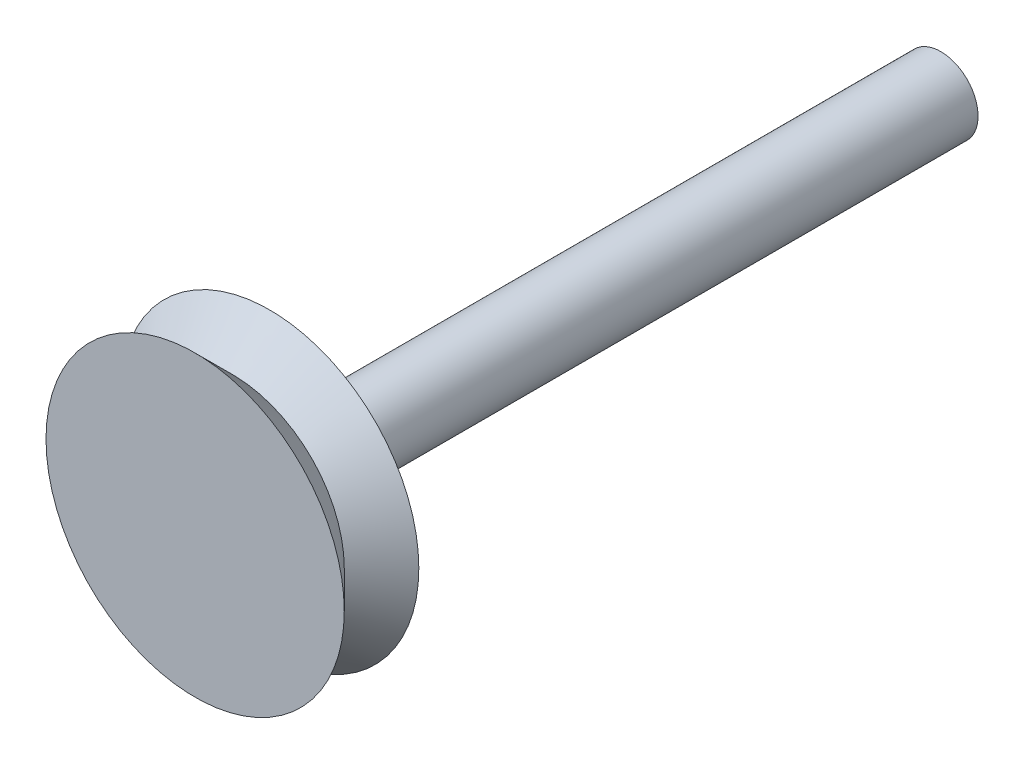
ISO-10303-21;
HEADER;
FILE_DESCRIPTION(('STEP AP214'),'2;1');
FILE_NAME('part.step','',(''),(''),'','','');
FILE_SCHEMA(('AUTOMOTIVE_DESIGN { 1 0 10303 214 1 1 1 1 }'));
ENDSEC;
DATA;
#1=APPLICATION_CONTEXT('core data for automotive mechanical design processes');
#2=APPLICATION_PROTOCOL_DEFINITION('international standard','automotive_design',2000,#1);
#3=PRODUCT_CONTEXT('',#1,'mechanical');
#4=PRODUCT('Part','Part','',(#3));
#5=PRODUCT_RELATED_PRODUCT_CATEGORY('part','',(#4));
#6=PRODUCT_DEFINITION_FORMATION('','',#4);
#7=PRODUCT_DEFINITION_CONTEXT('part definition',#1,'design');
#8=PRODUCT_DEFINITION('design','',#6,#7);
#9=PRODUCT_DEFINITION_SHAPE('','',#8);
#10=(LENGTH_UNIT() NAMED_UNIT(*) SI_UNIT(.MILLI.,.METRE.));
#11=(NAMED_UNIT(*) PLANE_ANGLE_UNIT() SI_UNIT($,.RADIAN.));
#12=(NAMED_UNIT(*) SI_UNIT($,.STERADIAN.) SOLID_ANGLE_UNIT());
#13=UNCERTAINTY_MEASURE_WITH_UNIT(LENGTH_MEASURE(1.E-05),#10,'distance_accuracy_value','');
#14=(GEOMETRIC_REPRESENTATION_CONTEXT(3) GLOBAL_UNCERTAINTY_ASSIGNED_CONTEXT((#13)) GLOBAL_UNIT_ASSIGNED_CONTEXT((#10,
#11,#12)) REPRESENTATION_CONTEXT('',''));
#15=CARTESIAN_POINT('',(0.,0.,0.));
#16=DIRECTION('',(0.,0.,1.));
#17=DIRECTION('',(1.,0.,0.));
#18=AXIS2_PLACEMENT_3D('',#15,#16,#17);
#19=CARTESIAN_POINT('',(0.,0.,0.));
#20=DIRECTION('',(0.,0.,1.));
#21=DIRECTION('',(1.,0.,0.));
#22=AXIS2_PLACEMENT_3D('',#19,#20,#21);
#23=PLANE('',#22);
#24=CARTESIAN_POINT('',(0.,0.,0.));
#25=DIRECTION('',(0.,0.,-1.));
#26=DIRECTION('',(-1.,0.,0.));
#27=AXIS2_PLACEMENT_3D('',#24,#25,#26);
#28=CIRCLE('',#27,1.);
#29=CARTESIAN_POINT('',(-1.,0.,0.));
#30=VERTEX_POINT('',#29);
#31=EDGE_CURVE('E10',#30,#30,#28,.T.);
#32=ORIENTED_EDGE('',*,*,#31,.F.);
#33=EDGE_LOOP('',(#32));
#34=FACE_BOUND('',#33,.T.);
#35=CARTESIAN_POINT('',(0.,0.,0.));
#36=DIRECTION('',(0.,0.,1.));
#37=DIRECTION('',(1.,0.,0.));
#38=AXIS2_PLACEMENT_3D('',#35,#36,#37);
#39=CIRCLE('',#38,4.);
#40=CARTESIAN_POINT('',(4.,0.,0.));
#41=VERTEX_POINT('',#40);
#42=EDGE_CURVE('E52',#41,#41,#39,.T.);
#43=ORIENTED_EDGE('',*,*,#42,.F.);
#44=EDGE_LOOP('',(#43));
#45=FACE_BOUND('',#44,.T.);
#46=ADVANCED_FACE('F33',(#34,#45),#23,.F.);
#47=CARTESIAN_POINT('',(0.,0.,-18.));
#48=DIRECTION('',(0.,0.,1.));
#49=DIRECTION('',(1.,0.,0.));
#50=AXIS2_PLACEMENT_3D('',#47,#48,#49);
#51=CYLINDRICAL_SURFACE('',#50,1.);
#52=CARTESIAN_POINT('',(0.,0.,-18.));
#53=DIRECTION('',(0.,0.,-1.));
#54=DIRECTION('',(-1.,0.,0.));
#55=AXIS2_PLACEMENT_3D('',#52,#53,#54);
#56=CIRCLE('',#55,1.);
#57=CARTESIAN_POINT('',(-1.,0.,-18.));
#58=VERTEX_POINT('',#57);
#59=EDGE_CURVE('E39',#58,#58,#56,.T.);
#60=ORIENTED_EDGE('',*,*,#59,.F.);
#61=EDGE_LOOP('',(#60));
#62=FACE_BOUND('',#61,.T.);
#63=ORIENTED_EDGE('',*,*,#31,.T.);
#64=EDGE_LOOP('',(#63));
#65=FACE_BOUND('',#64,.T.);
#66=ADVANCED_FACE('F60',(#62,#65),#51,.T.);
#67=CARTESIAN_POINT('',(0.,0.,-18.));
#68=DIRECTION('',(0.,0.,-1.));
#69=DIRECTION('',(-1.,0.,0.));
#70=AXIS2_PLACEMENT_3D('',#67,#68,#69);
#71=PLANE('',#70);
#72=ORIENTED_EDGE('',*,*,#59,.T.);
#73=EDGE_LOOP('',(#72));
#74=FACE_BOUND('',#73,.T.);
#75=ADVANCED_FACE('F66',(#74),#71,.T.);
#76=CARTESIAN_POINT('',(0.,0.,2.));
#77=DIRECTION('',(0.,0.,1.));
#78=DIRECTION('',(1.,0.,0.));
#79=AXIS2_PLACEMENT_3D('',#76,#77,#78);
#80=CONICAL_SURFACE('',#79,4.,0.78539816339745);
#81=CARTESIAN_POINT('',(0.,0.,1.));
#82=DIRECTION('',(0.,0.,1.));
#83=DIRECTION('',(1.,0.,0.));
#84=AXIS2_PLACEMENT_3D('',#81,#82,#83);
#85=CIRCLE('',#84,3.);
#86=CARTESIAN_POINT('',(3.,0.,1.));
#87=VERTEX_POINT('',#86);
#88=EDGE_CURVE('E47',#87,#87,#85,.T.);
#89=ORIENTED_EDGE('',*,*,#88,.T.);
#90=EDGE_LOOP('',(#89));
#91=FACE_BOUND('',#90,.T.);
#92=CARTESIAN_POINT('',(0.,0.,2.));
#93=DIRECTION('',(0.,0.,1.));
#94=DIRECTION('',(1.,0.,0.));
#95=AXIS2_PLACEMENT_3D('',#92,#93,#94);
#96=CIRCLE('',#95,4.);
#97=CARTESIAN_POINT('',(4.,0.,2.));
#98=VERTEX_POINT('',#97);
#99=EDGE_CURVE('E43',#98,#98,#96,.T.);
#100=ORIENTED_EDGE('',*,*,#99,.F.);
#101=EDGE_LOOP('',(#100));
#102=FACE_BOUND('',#101,.T.);
#103=ADVANCED_FACE('F72',(#91,#102),#80,.T.);
#104=CARTESIAN_POINT('',(0.,0.,1.));
#105=DIRECTION('',(0.,0.,-1.));
#106=DIRECTION('',(-1.,0.,0.));
#107=AXIS2_PLACEMENT_3D('',#104,#105,#106);
#108=CONICAL_SURFACE('',#107,3.,0.78539816339745);
#109=ORIENTED_EDGE('',*,*,#42,.T.);
#110=EDGE_LOOP('',(#109));
#111=FACE_BOUND('',#110,.T.);
#112=ORIENTED_EDGE('',*,*,#88,.F.);
#113=EDGE_LOOP('',(#112));
#114=FACE_BOUND('',#113,.T.);
#115=ADVANCED_FACE('F56',(#111,#114),#108,.T.);
#116=CARTESIAN_POINT('',(0.,0.,2.));
#117=DIRECTION('',(0.,0.,1.));
#118=DIRECTION('',(1.,0.,0.));
#119=AXIS2_PLACEMENT_3D('',#116,#117,#118);
#120=PLANE('',#119);
#121=ORIENTED_EDGE('',*,*,#99,.T.);
#122=EDGE_LOOP('',(#121));
#123=FACE_BOUND('',#122,.T.);
#124=ADVANCED_FACE('F75',(#123),#120,.T.);
#125=CLOSED_SHELL('',(#46,#66,#75,#103,#115,#124));
#126=MANIFOLD_SOLID_BREP('B2',#125);
#127=ADVANCED_BREP_SHAPE_REPRESENTATION('',(#18,#126),#14);
#128=SHAPE_DEFINITION_REPRESENTATION(#9,#127);
ENDSEC;
END-ISO-10303-21;
